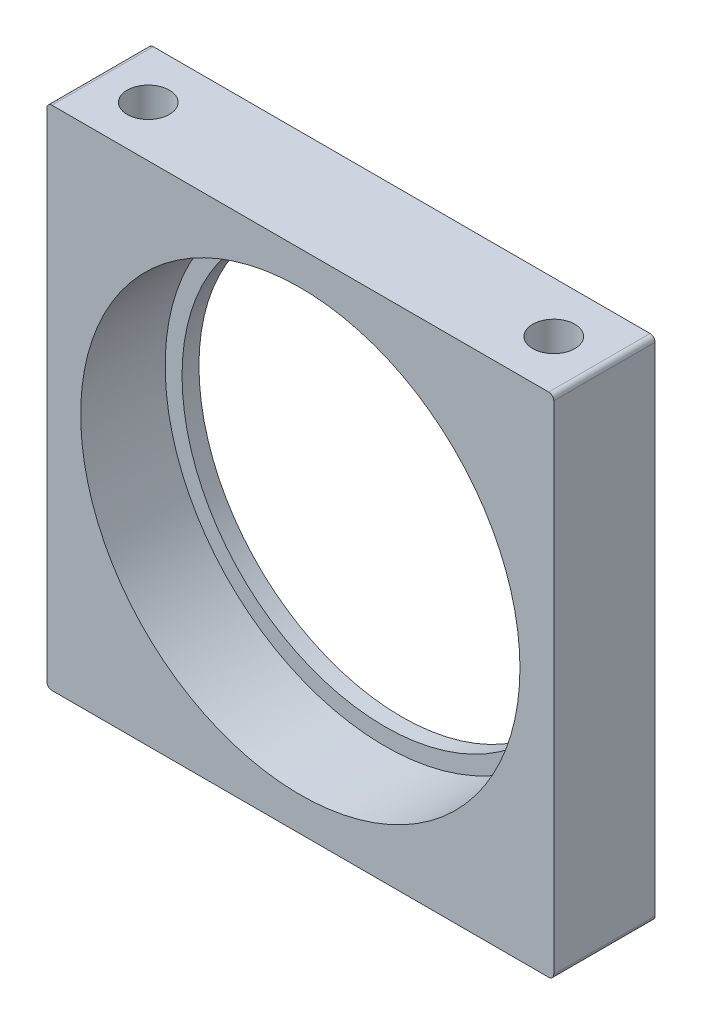
ISO-10303-21;
HEADER;
FILE_DESCRIPTION(('STEP AP214'),'2;1');
FILE_NAME('part.step','',(''),(''),'','','');
FILE_SCHEMA(('AUTOMOTIVE_DESIGN { 1 0 10303 214 1 1 1 1 }'));
ENDSEC;
DATA;
#1=APPLICATION_CONTEXT('core data for automotive mechanical design processes');
#2=APPLICATION_PROTOCOL_DEFINITION('international standard','automotive_design',2000,#1);
#3=PRODUCT_CONTEXT('',#1,'mechanical');
#4=PRODUCT('Part','Part','',(#3));
#5=PRODUCT_RELATED_PRODUCT_CATEGORY('part','',(#4));
#6=PRODUCT_DEFINITION_FORMATION('','',#4);
#7=PRODUCT_DEFINITION_CONTEXT('part definition',#1,'design');
#8=PRODUCT_DEFINITION('design','',#6,#7);
#9=PRODUCT_DEFINITION_SHAPE('','',#8);
#10=(LENGTH_UNIT() NAMED_UNIT(*) SI_UNIT(.MILLI.,.METRE.));
#11=(NAMED_UNIT(*) PLANE_ANGLE_UNIT() SI_UNIT($,.RADIAN.));
#12=(NAMED_UNIT(*) SI_UNIT($,.STERADIAN.) SOLID_ANGLE_UNIT());
#13=UNCERTAINTY_MEASURE_WITH_UNIT(LENGTH_MEASURE(1.E-05),#10,'distance_accuracy_value','');
#14=(GEOMETRIC_REPRESENTATION_CONTEXT(3) GLOBAL_UNCERTAINTY_ASSIGNED_CONTEXT((#13)) GLOBAL_UNIT_ASSIGNED_CONTEXT((#10,
#11,#12)) REPRESENTATION_CONTEXT('',''));
#15=CARTESIAN_POINT('',(0.,0.,0.));
#16=DIRECTION('',(0.,0.,1.));
#17=DIRECTION('',(1.,0.,0.));
#18=AXIS2_PLACEMENT_3D('',#15,#16,#17);
#19=CARTESIAN_POINT('',(15.,15.,6.));
#20=DIRECTION('',(0.,0.,-1.));
#21=DIRECTION('',(-1.,0.,0.));
#22=AXIS2_PLACEMENT_3D('',#19,#20,#21);
#23=CYLINDRICAL_SURFACE('',#22,12.);
#24=CARTESIAN_POINT('',(15.,15.,0.));
#25=DIRECTION('',(0.,0.,1.));
#26=DIRECTION('',(1.,0.,0.));
#27=AXIS2_PLACEMENT_3D('',#24,#25,#26);
#28=CIRCLE('',#27,12.);
#29=CARTESIAN_POINT('',(27.,15.,0.));
#30=VERTEX_POINT('',#29);
#31=EDGE_CURVE('E222',#30,#30,#28,.T.);
#32=ORIENTED_EDGE('',*,*,#31,.F.);
#33=EDGE_LOOP('',(#32));
#34=FACE_BOUND('',#33,.T.);
#35=CARTESIAN_POINT('',(15.,15.,1.));
#36=DIRECTION('',(0.,0.,1.));
#37=DIRECTION('',(1.,0.,0.));
#38=AXIS2_PLACEMENT_3D('',#35,#36,#37);
#39=CIRCLE('',#38,12.);
#40=CARTESIAN_POINT('',(27.,15.,1.));
#41=VERTEX_POINT('',#40);
#42=EDGE_CURVE('E219',#41,#41,#39,.T.);
#43=ORIENTED_EDGE('',*,*,#42,.T.);
#44=EDGE_LOOP('',(#43));
#45=FACE_BOUND('',#44,.T.);
#46=ADVANCED_FACE('F107',(#34,#45),#23,.F.);
#47=CARTESIAN_POINT('',(0.,0.,6.));
#48=DIRECTION('',(0.,0.,-1.));
#49=DIRECTION('',(-1.,0.,0.));
#50=AXIS2_PLACEMENT_3D('',#47,#48,#49);
#51=PLANE('',#50);
#52=CARTESIAN_POINT('',(15.,15.,6.));
#53=DIRECTION('',(0.,0.,1.));
#54=DIRECTION('',(1.,0.,0.));
#55=AXIS2_PLACEMENT_3D('',#52,#53,#54);
#56=CIRCLE('',#55,13.);
#57=CARTESIAN_POINT('',(28.,15.,6.));
#58=VERTEX_POINT('',#57);
#59=EDGE_CURVE('E215',#58,#58,#56,.T.);
#60=ORIENTED_EDGE('',*,*,#59,.F.);
#61=EDGE_LOOP('',(#60));
#62=FACE_BOUND('',#61,.T.);
#63=DIRECTION('',(1.,0.,0.));
#64=VECTOR('',#63,1.);
#65=CARTESIAN_POINT('',(0.,0.,6.));
#66=LINE('',#65,#64);
#67=CARTESIAN_POINT('',(0.3,0.,6.));
#68=VERTEX_POINT('',#67);
#69=CARTESIAN_POINT('',(29.7,0.,6.));
#70=VERTEX_POINT('',#69);
#71=EDGE_CURVE('E229',#68,#70,#66,.T.);
#72=ORIENTED_EDGE('',*,*,#71,.T.);
#73=CARTESIAN_POINT('',(29.7,0.3,6.));
#74=DIRECTION('',(0.,0.,-1.));
#75=DIRECTION('',(-1.,0.,0.));
#76=AXIS2_PLACEMENT_3D('',#73,#74,#75);
#77=CIRCLE('',#76,0.3);
#78=CARTESIAN_POINT('',(30.,0.3,6.));
#79=VERTEX_POINT('',#78);
#80=EDGE_CURVE('E271',#70,#79,#77,.F.);
#81=ORIENTED_EDGE('',*,*,#80,.T.);
#82=DIRECTION('',(0.,1.,0.));
#83=VECTOR('',#82,1.);
#84=CARTESIAN_POINT('',(30.,0.,6.));
#85=LINE('',#84,#83);
#86=CARTESIAN_POINT('',(30.,29.7,6.));
#87=VERTEX_POINT('',#86);
#88=EDGE_CURVE('E233',#79,#87,#85,.T.);
#89=ORIENTED_EDGE('',*,*,#88,.T.);
#90=CARTESIAN_POINT('',(29.7,29.7,6.));
#91=DIRECTION('',(0.,0.,-1.));
#92=DIRECTION('',(-1.,0.,0.));
#93=AXIS2_PLACEMENT_3D('',#90,#91,#92);
#94=CIRCLE('',#93,0.3);
#95=CARTESIAN_POINT('',(29.7,30.,6.));
#96=VERTEX_POINT('',#95);
#97=EDGE_CURVE('E127',#87,#96,#94,.F.);
#98=ORIENTED_EDGE('',*,*,#97,.T.);
#99=DIRECTION('',(-1.,0.,0.));
#100=VECTOR('',#99,1.);
#101=CARTESIAN_POINT('',(0.,30.,6.));
#102=LINE('',#101,#100);
#103=CARTESIAN_POINT('',(0.3,30.,6.));
#104=VERTEX_POINT('',#103);
#105=EDGE_CURVE('E235',#96,#104,#102,.T.);
#106=ORIENTED_EDGE('',*,*,#105,.T.);
#107=CARTESIAN_POINT('',(0.3,29.7,6.));
#108=DIRECTION('',(0.,0.,-1.));
#109=DIRECTION('',(-1.,0.,0.));
#110=AXIS2_PLACEMENT_3D('',#107,#108,#109);
#111=CIRCLE('',#110,0.3);
#112=CARTESIAN_POINT('',(0.,29.7,6.));
#113=VERTEX_POINT('',#112);
#114=EDGE_CURVE('E267',#104,#113,#111,.F.);
#115=ORIENTED_EDGE('',*,*,#114,.T.);
#116=DIRECTION('',(0.,-1.,0.));
#117=VECTOR('',#116,1.);
#118=CARTESIAN_POINT('',(0.,0.,6.));
#119=LINE('',#118,#117);
#120=CARTESIAN_POINT('',(0.,0.3,6.));
#121=VERTEX_POINT('',#120);
#122=EDGE_CURVE('E226',#113,#121,#119,.T.);
#123=ORIENTED_EDGE('',*,*,#122,.T.);
#124=CARTESIAN_POINT('',(0.3,0.3,6.));
#125=DIRECTION('',(0.,0.,-1.));
#126=DIRECTION('',(-1.,0.,0.));
#127=AXIS2_PLACEMENT_3D('',#124,#125,#126);
#128=CIRCLE('',#127,0.3);
#129=EDGE_CURVE('E269',#121,#68,#128,.F.);
#130=ORIENTED_EDGE('',*,*,#129,.T.);
#131=EDGE_LOOP('',(#72,#81,#89,#98,#106,#115,#123,#130));
#132=FACE_BOUND('',#131,.T.);
#133=ADVANCED_FACE('F296',(#62,#132),#51,.F.);
#134=CARTESIAN_POINT('',(0.,0.,0.));
#135=DIRECTION('',(0.,0.,-1.));
#136=DIRECTION('',(-1.,0.,0.));
#137=AXIS2_PLACEMENT_3D('',#134,#135,#136);
#138=PLANE('',#137);
#139=DIRECTION('',(0.,1.,0.));
#140=VECTOR('',#139,1.);
#141=CARTESIAN_POINT('',(30.,0.,0.));
#142=LINE('',#141,#140);
#143=CARTESIAN_POINT('',(30.,0.3,0.));
#144=VERTEX_POINT('',#143);
#145=CARTESIAN_POINT('',(30.,29.7,0.));
#146=VERTEX_POINT('',#145);
#147=EDGE_CURVE('E243',#144,#146,#142,.T.);
#148=ORIENTED_EDGE('',*,*,#147,.F.);
#149=CARTESIAN_POINT('',(29.7,0.3,0.));
#150=DIRECTION('',(0.,0.,-1.));
#151=DIRECTION('',(-1.,0.,0.));
#152=AXIS2_PLACEMENT_3D('',#149,#150,#151);
#153=CIRCLE('',#152,0.3);
#154=CARTESIAN_POINT('',(29.7,0.,0.));
#155=VERTEX_POINT('',#154);
#156=EDGE_CURVE('E259',#144,#155,#153,.T.);
#157=ORIENTED_EDGE('',*,*,#156,.T.);
#158=DIRECTION('',(1.,0.,0.));
#159=VECTOR('',#158,1.);
#160=CARTESIAN_POINT('',(0.,0.,0.));
#161=LINE('',#160,#159);
#162=CARTESIAN_POINT('',(0.3,0.,0.));
#163=VERTEX_POINT('',#162);
#164=EDGE_CURVE('E240',#163,#155,#161,.T.);
#165=ORIENTED_EDGE('',*,*,#164,.F.);
#166=CARTESIAN_POINT('',(0.3,0.3,0.));
#167=DIRECTION('',(0.,0.,-1.));
#168=DIRECTION('',(-1.,0.,0.));
#169=AXIS2_PLACEMENT_3D('',#166,#167,#168);
#170=CIRCLE('',#169,0.3);
#171=CARTESIAN_POINT('',(0.,0.3,0.));
#172=VERTEX_POINT('',#171);
#173=EDGE_CURVE('E257',#163,#172,#170,.T.);
#174=ORIENTED_EDGE('',*,*,#173,.T.);
#175=DIRECTION('',(0.,-1.,0.));
#176=VECTOR('',#175,1.);
#177=CARTESIAN_POINT('',(0.,0.,0.));
#178=LINE('',#177,#176);
#179=CARTESIAN_POINT('',(0.,29.7,0.));
#180=VERTEX_POINT('',#179);
#181=EDGE_CURVE('E225',#180,#172,#178,.T.);
#182=ORIENTED_EDGE('',*,*,#181,.F.);
#183=CARTESIAN_POINT('',(0.3,29.7,0.));
#184=DIRECTION('',(0.,0.,-1.));
#185=DIRECTION('',(-1.,0.,0.));
#186=AXIS2_PLACEMENT_3D('',#183,#184,#185);
#187=CIRCLE('',#186,0.3);
#188=CARTESIAN_POINT('',(0.3,30.,0.));
#189=VERTEX_POINT('',#188);
#190=EDGE_CURVE('E255',#180,#189,#187,.T.);
#191=ORIENTED_EDGE('',*,*,#190,.T.);
#192=DIRECTION('',(-1.,0.,0.));
#193=VECTOR('',#192,1.);
#194=CARTESIAN_POINT('',(0.,30.,0.));
#195=LINE('',#194,#193);
#196=CARTESIAN_POINT('',(29.7,30.,0.));
#197=VERTEX_POINT('',#196);
#198=EDGE_CURVE('E230',#197,#189,#195,.T.);
#199=ORIENTED_EDGE('',*,*,#198,.F.);
#200=CARTESIAN_POINT('',(29.7,29.7,0.));
#201=DIRECTION('',(0.,0.,-1.));
#202=DIRECTION('',(-1.,0.,0.));
#203=AXIS2_PLACEMENT_3D('',#200,#201,#202);
#204=CIRCLE('',#203,0.3);
#205=EDGE_CURVE('E253',#197,#146,#204,.T.);
#206=ORIENTED_EDGE('',*,*,#205,.T.);
#207=EDGE_LOOP('',(#148,#157,#165,#174,#182,#191,#199,#206));
#208=FACE_BOUND('',#207,.T.);
#209=ORIENTED_EDGE('',*,*,#31,.T.);
#210=EDGE_LOOP('',(#209));
#211=FACE_BOUND('',#210,.T.);
#212=ADVANCED_FACE('F284',(#208,#211),#138,.T.);
#213=CARTESIAN_POINT('',(0.,0.,6.));
#214=DIRECTION('',(1.,0.,0.));
#215=DIRECTION('',(0.,0.,-1.));
#216=AXIS2_PLACEMENT_3D('',#213,#214,#215);
#217=PLANE('',#216);
#218=ORIENTED_EDGE('',*,*,#181,.T.);
#219=DIRECTION('',(0.,0.,-1.));
#220=VECTOR('',#219,1.);
#221=CARTESIAN_POINT('',(0.,0.3,6.));
#222=LINE('',#221,#220);
#223=EDGE_CURVE('E276',#172,#121,#222,.F.);
#224=ORIENTED_EDGE('',*,*,#223,.T.);
#225=ORIENTED_EDGE('',*,*,#122,.F.);
#226=DIRECTION('',(0.,0.,-1.));
#227=VECTOR('',#226,1.);
#228=CARTESIAN_POINT('',(0.,29.7,6.));
#229=LINE('',#228,#227);
#230=EDGE_CURVE('E273',#113,#180,#229,.T.);
#231=ORIENTED_EDGE('',*,*,#230,.T.);
#232=EDGE_LOOP('',(#218,#224,#225,#231));
#233=FACE_BOUND('',#232,.T.);
#234=ADVANCED_FACE('F293',(#233),#217,.F.);
#235=CARTESIAN_POINT('',(0.,0.,6.));
#236=DIRECTION('',(0.,1.,0.));
#237=DIRECTION('',(0.,0.,1.));
#238=AXIS2_PLACEMENT_3D('',#235,#236,#237);
#239=PLANE('',#238);
#240=CARTESIAN_POINT('',(3.,0.,3.));
#241=DIRECTION('',(0.,-1.,0.));
#242=DIRECTION('',(0.,0.,-1.));
#243=AXIS2_PLACEMENT_3D('',#240,#241,#242);
#244=CIRCLE('',#243,1.24999999999999);
#245=CARTESIAN_POINT('',(3.,0.,1.75000000000001));
#246=VERTEX_POINT('',#245);
#247=EDGE_CURVE('E193',#246,#246,#244,.T.);
#248=ORIENTED_EDGE('',*,*,#247,.F.);
#249=EDGE_LOOP('',(#248));
#250=FACE_BOUND('',#249,.T.);
#251=CARTESIAN_POINT('',(27.,0.,3.));
#252=DIRECTION('',(0.,-1.,0.));
#253=DIRECTION('',(0.,0.,-1.));
#254=AXIS2_PLACEMENT_3D('',#251,#252,#253);
#255=CIRCLE('',#254,1.24999999999999);
#256=CARTESIAN_POINT('',(27.,0.,1.75000000000001));
#257=VERTEX_POINT('',#256);
#258=EDGE_CURVE('E192',#257,#257,#255,.T.);
#259=ORIENTED_EDGE('',*,*,#258,.F.);
#260=EDGE_LOOP('',(#259));
#261=FACE_BOUND('',#260,.T.);
#262=ORIENTED_EDGE('',*,*,#164,.T.);
#263=DIRECTION('',(0.,0.,-1.));
#264=VECTOR('',#263,1.);
#265=CARTESIAN_POINT('',(29.7,0.,6.));
#266=LINE('',#265,#264);
#267=EDGE_CURVE('E264',#155,#70,#266,.F.);
#268=ORIENTED_EDGE('',*,*,#267,.T.);
#269=ORIENTED_EDGE('',*,*,#71,.F.);
#270=DIRECTION('',(0.,0.,-1.));
#271=VECTOR('',#270,1.);
#272=CARTESIAN_POINT('',(0.3,0.,6.));
#273=LINE('',#272,#271);
#274=EDGE_CURVE('E261',#68,#163,#273,.T.);
#275=ORIENTED_EDGE('',*,*,#274,.T.);
#276=EDGE_LOOP('',(#262,#268,#269,#275));
#277=FACE_BOUND('',#276,.T.);
#278=ADVANCED_FACE('F303',(#250,#261,#277),#239,.F.);
#279=CARTESIAN_POINT('',(30.,0.,6.));
#280=DIRECTION('',(-1.,0.,0.));
#281=DIRECTION('',(0.,0.,1.));
#282=AXIS2_PLACEMENT_3D('',#279,#280,#281);
#283=PLANE('',#282);
#284=ORIENTED_EDGE('',*,*,#88,.F.);
#285=DIRECTION('',(0.,0.,-1.));
#286=VECTOR('',#285,1.);
#287=CARTESIAN_POINT('',(30.,0.3,6.));
#288=LINE('',#287,#286);
#289=EDGE_CURVE('E250',#79,#144,#288,.T.);
#290=ORIENTED_EDGE('',*,*,#289,.T.);
#291=ORIENTED_EDGE('',*,*,#147,.T.);
#292=DIRECTION('',(0.,0.,-1.));
#293=VECTOR('',#292,1.);
#294=CARTESIAN_POINT('',(30.,29.7,6.));
#295=LINE('',#294,#293);
#296=EDGE_CURVE('E237',#146,#87,#295,.F.);
#297=ORIENTED_EDGE('',*,*,#296,.T.);
#298=EDGE_LOOP('',(#284,#290,#291,#297));
#299=FACE_BOUND('',#298,.T.);
#300=ADVANCED_FACE('F311',(#299),#283,.F.);
#301=CARTESIAN_POINT('',(0.,30.,6.));
#302=DIRECTION('',(0.,-1.,0.));
#303=DIRECTION('',(0.,0.,-1.));
#304=AXIS2_PLACEMENT_3D('',#301,#302,#303);
#305=PLANE('',#304);
#306=CARTESIAN_POINT('',(3.,30.,3.));
#307=DIRECTION('',(0.,1.,0.));
#308=DIRECTION('',(0.,0.,1.));
#309=AXIS2_PLACEMENT_3D('',#306,#307,#308);
#310=CIRCLE('',#309,1.24999999999999);
#311=CARTESIAN_POINT('',(3.,30.,4.24999999999999));
#312=VERTEX_POINT('',#311);
#313=EDGE_CURVE('E203',#312,#312,#310,.T.);
#314=ORIENTED_EDGE('',*,*,#313,.F.);
#315=EDGE_LOOP('',(#314));
#316=FACE_BOUND('',#315,.T.);
#317=CARTESIAN_POINT('',(27.,30.,3.));
#318=DIRECTION('',(0.,1.,0.));
#319=DIRECTION('',(0.,0.,1.));
#320=AXIS2_PLACEMENT_3D('',#317,#318,#319);
#321=CIRCLE('',#320,1.24999999999999);
#322=CARTESIAN_POINT('',(27.,30.,4.24999999999999));
#323=VERTEX_POINT('',#322);
#324=EDGE_CURVE('E209',#323,#323,#321,.T.);
#325=ORIENTED_EDGE('',*,*,#324,.F.);
#326=EDGE_LOOP('',(#325));
#327=FACE_BOUND('',#326,.T.);
#328=ORIENTED_EDGE('',*,*,#198,.T.);
#329=DIRECTION('',(0.,0.,-1.));
#330=VECTOR('',#329,1.);
#331=CARTESIAN_POINT('',(0.3,30.,6.));
#332=LINE('',#331,#330);
#333=EDGE_CURVE('E14',#189,#104,#332,.F.);
#334=ORIENTED_EDGE('',*,*,#333,.T.);
#335=ORIENTED_EDGE('',*,*,#105,.F.);
#336=DIRECTION('',(0.,0.,-1.));
#337=VECTOR('',#336,1.);
#338=CARTESIAN_POINT('',(29.7,30.,6.));
#339=LINE('',#338,#337);
#340=EDGE_CURVE('E115',#96,#197,#339,.T.);
#341=ORIENTED_EDGE('',*,*,#340,.T.);
#342=EDGE_LOOP('',(#328,#334,#335,#341));
#343=FACE_BOUND('',#342,.T.);
#344=ADVANCED_FACE('F280',(#316,#327,#343),#305,.F.);
#345=CARTESIAN_POINT('',(15.,15.,1.));
#346=DIRECTION('',(0.,0.,1.));
#347=DIRECTION('',(1.,0.,0.));
#348=AXIS2_PLACEMENT_3D('',#345,#346,#347);
#349=CYLINDRICAL_SURFACE('',#348,13.);
#350=CARTESIAN_POINT('',(15.,15.,1.));
#351=DIRECTION('',(0.,0.,1.));
#352=DIRECTION('',(1.,0.,0.));
#353=AXIS2_PLACEMENT_3D('',#350,#351,#352);
#354=CIRCLE('',#353,13.);
#355=CARTESIAN_POINT('',(28.,15.,1.));
#356=VERTEX_POINT('',#355);
#357=EDGE_CURVE('E216',#356,#356,#354,.T.);
#358=ORIENTED_EDGE('',*,*,#357,.F.);
#359=EDGE_LOOP('',(#358));
#360=FACE_BOUND('',#359,.T.);
#361=ORIENTED_EDGE('',*,*,#59,.T.);
#362=EDGE_LOOP('',(#361));
#363=FACE_BOUND('',#362,.T.);
#364=ADVANCED_FACE('F328',(#360,#363),#349,.F.);
#365=CARTESIAN_POINT('',(15.,15.,1.));
#366=DIRECTION('',(0.,0.,1.));
#367=DIRECTION('',(1.,0.,0.));
#368=AXIS2_PLACEMENT_3D('',#365,#366,#367);
#369=PLANE('',#368);
#370=ORIENTED_EDGE('',*,*,#42,.F.);
#371=EDGE_LOOP('',(#370));
#372=FACE_BOUND('',#371,.T.);
#373=ORIENTED_EDGE('',*,*,#357,.T.);
#374=EDGE_LOOP('',(#373));
#375=FACE_BOUND('',#374,.T.);
#376=ADVANCED_FACE('F433',(#372,#375),#369,.T.);
#377=CARTESIAN_POINT('',(27.,24.,3.));
#378=DIRECTION('',(0.,1.,0.));
#379=DIRECTION('',(0.,0.,1.));
#380=AXIS2_PLACEMENT_3D('',#377,#378,#379);
#381=CONICAL_SURFACE('',#380,1.25,1.02974425867665);
#382=CARTESIAN_POINT('',(27.,23.2489242262155,3.));
#383=VERTEX_POINT('',#382);
#384=VERTEX_LOOP('',#383);
#385=FACE_BOUND('',#384,.T.);
#386=CARTESIAN_POINT('',(27.,24.,3.));
#387=DIRECTION('',(0.,1.,0.));
#388=DIRECTION('',(0.,0.,1.));
#389=AXIS2_PLACEMENT_3D('',#386,#387,#388);
#390=CIRCLE('',#389,1.25);
#391=CARTESIAN_POINT('',(27.,24.,4.25));
#392=VERTEX_POINT('',#391);
#393=EDGE_CURVE('E212',#392,#392,#390,.T.);
#394=ORIENTED_EDGE('',*,*,#393,.T.);
#395=EDGE_LOOP('',(#394));
#396=FACE_BOUND('',#395,.T.);
#397=ADVANCED_FACE('F424',(#385,#396),#381,.F.);
#398=CARTESIAN_POINT('',(27.,30.,3.));
#399=DIRECTION('',(0.,1.,0.));
#400=DIRECTION('',(0.,0.,1.));
#401=AXIS2_PLACEMENT_3D('',#398,#399,#400);
#402=CYLINDRICAL_SURFACE('',#401,1.24999999999999);
#403=ORIENTED_EDGE('',*,*,#393,.F.);
#404=EDGE_LOOP('',(#403));
#405=FACE_BOUND('',#404,.T.);
#406=ORIENTED_EDGE('',*,*,#324,.T.);
#407=EDGE_LOOP('',(#406));
#408=FACE_BOUND('',#407,.T.);
#409=ADVANCED_FACE('F415',(#405,#408),#402,.F.);
#410=CARTESIAN_POINT('',(3.,24.,3.));
#411=DIRECTION('',(0.,1.,0.));
#412=DIRECTION('',(0.,0.,1.));
#413=AXIS2_PLACEMENT_3D('',#410,#411,#412);
#414=CONICAL_SURFACE('',#413,1.25,1.02974425867665);
#415=CARTESIAN_POINT('',(3.,23.2489242262155,3.));
#416=VERTEX_POINT('',#415);
#417=VERTEX_LOOP('',#416);
#418=FACE_BOUND('',#417,.T.);
#419=CARTESIAN_POINT('',(3.,24.,3.));
#420=DIRECTION('',(0.,1.,0.));
#421=DIRECTION('',(0.,0.,1.));
#422=AXIS2_PLACEMENT_3D('',#419,#420,#421);
#423=CIRCLE('',#422,1.25);
#424=CARTESIAN_POINT('',(3.,24.,4.25));
#425=VERTEX_POINT('',#424);
#426=EDGE_CURVE('E206',#425,#425,#423,.T.);
#427=ORIENTED_EDGE('',*,*,#426,.T.);
#428=EDGE_LOOP('',(#427));
#429=FACE_BOUND('',#428,.T.);
#430=ADVANCED_FACE('F406',(#418,#429),#414,.F.);
#431=CARTESIAN_POINT('',(3.,30.,3.));
#432=DIRECTION('',(0.,1.,0.));
#433=DIRECTION('',(0.,0.,1.));
#434=AXIS2_PLACEMENT_3D('',#431,#432,#433);
#435=CYLINDRICAL_SURFACE('',#434,1.24999999999999);
#436=ORIENTED_EDGE('',*,*,#426,.F.);
#437=EDGE_LOOP('',(#436));
#438=FACE_BOUND('',#437,.T.);
#439=ORIENTED_EDGE('',*,*,#313,.T.);
#440=EDGE_LOOP('',(#439));
#441=FACE_BOUND('',#440,.T.);
#442=ADVANCED_FACE('F397',(#438,#441),#435,.F.);
#443=CARTESIAN_POINT('',(27.,6.,3.));
#444=DIRECTION('',(0.,-1.,0.));
#445=DIRECTION('',(0.,0.,-1.));
#446=AXIS2_PLACEMENT_3D('',#443,#444,#445);
#447=CONICAL_SURFACE('',#446,1.25,1.02974425867665);
#448=CARTESIAN_POINT('',(27.,6.75107577378445,3.));
#449=VERTEX_POINT('',#448);
#450=VERTEX_LOOP('',#449);
#451=FACE_BOUND('',#450,.T.);
#452=CARTESIAN_POINT('',(27.,6.,3.));
#453=DIRECTION('',(0.,-1.,0.));
#454=DIRECTION('',(0.,0.,-1.));
#455=AXIS2_PLACEMENT_3D('',#452,#453,#454);
#456=CIRCLE('',#455,1.25);
#457=CARTESIAN_POINT('',(27.,6.,1.75));
#458=VERTEX_POINT('',#457);
#459=EDGE_CURVE('E196',#458,#458,#456,.T.);
#460=ORIENTED_EDGE('',*,*,#459,.T.);
#461=EDGE_LOOP('',(#460));
#462=FACE_BOUND('',#461,.T.);
#463=ADVANCED_FACE('F388',(#451,#462),#447,.F.);
#464=CARTESIAN_POINT('',(27.,0.,3.));
#465=DIRECTION('',(0.,-1.,0.));
#466=DIRECTION('',(0.,0.,-1.));
#467=AXIS2_PLACEMENT_3D('',#464,#465,#466);
#468=CYLINDRICAL_SURFACE('',#467,1.24999999999999);
#469=ORIENTED_EDGE('',*,*,#459,.F.);
#470=EDGE_LOOP('',(#469));
#471=FACE_BOUND('',#470,.T.);
#472=ORIENTED_EDGE('',*,*,#258,.T.);
#473=EDGE_LOOP('',(#472));
#474=FACE_BOUND('',#473,.T.);
#475=ADVANCED_FACE('F186',(#471,#474),#468,.F.);
#476=CARTESIAN_POINT('',(3.,6.,3.));
#477=DIRECTION('',(0.,-1.,0.));
#478=DIRECTION('',(0.,0.,-1.));
#479=AXIS2_PLACEMENT_3D('',#476,#477,#478);
#480=CONICAL_SURFACE('',#479,1.25,1.02974425867665);
#481=CARTESIAN_POINT('',(3.,6.75107577378445,3.));
#482=VERTEX_POINT('',#481);
#483=VERTEX_LOOP('',#482);
#484=FACE_BOUND('',#483,.T.);
#485=CARTESIAN_POINT('',(3.,6.,3.));
#486=DIRECTION('',(0.,-1.,0.));
#487=DIRECTION('',(0.,0.,-1.));
#488=AXIS2_PLACEMENT_3D('',#485,#486,#487);
#489=CIRCLE('',#488,1.25);
#490=CARTESIAN_POINT('',(3.,6.,1.75));
#491=VERTEX_POINT('',#490);
#492=EDGE_CURVE('E190',#491,#491,#489,.T.);
#493=ORIENTED_EDGE('',*,*,#492,.T.);
#494=EDGE_LOOP('',(#493));
#495=FACE_BOUND('',#494,.T.);
#496=ADVANCED_FACE('F182',(#484,#495),#480,.F.);
#497=CARTESIAN_POINT('',(3.,0.,3.));
#498=DIRECTION('',(0.,-1.,0.));
#499=DIRECTION('',(0.,0.,-1.));
#500=AXIS2_PLACEMENT_3D('',#497,#498,#499);
#501=CYLINDRICAL_SURFACE('',#500,1.24999999999999);
#502=ORIENTED_EDGE('',*,*,#492,.F.);
#503=EDGE_LOOP('',(#502));
#504=FACE_BOUND('',#503,.T.);
#505=ORIENTED_EDGE('',*,*,#247,.T.);
#506=EDGE_LOOP('',(#505));
#507=FACE_BOUND('',#506,.T.);
#508=ADVANCED_FACE('F185',(#504,#507),#501,.F.);
#509=CARTESIAN_POINT('',(29.7,0.3,6.));
#510=DIRECTION('',(0.,0.,-1.));
#511=DIRECTION('',(-1.,0.,0.));
#512=AXIS2_PLACEMENT_3D('',#509,#510,#511);
#513=CYLINDRICAL_SURFACE('',#512,0.3);
#514=ORIENTED_EDGE('',*,*,#80,.F.);
#515=ORIENTED_EDGE('',*,*,#267,.F.);
#516=ORIENTED_EDGE('',*,*,#156,.F.);
#517=ORIENTED_EDGE('',*,*,#289,.F.);
#518=EDGE_LOOP('',(#514,#515,#516,#517));
#519=FACE_BOUND('',#518,.T.);
#520=ADVANCED_FACE('F308',(#519),#513,.T.);
#521=CARTESIAN_POINT('',(0.3,0.3,6.));
#522=DIRECTION('',(0.,0.,-1.));
#523=DIRECTION('',(-1.,0.,0.));
#524=AXIS2_PLACEMENT_3D('',#521,#522,#523);
#525=CYLINDRICAL_SURFACE('',#524,0.3);
#526=ORIENTED_EDGE('',*,*,#129,.F.);
#527=ORIENTED_EDGE('',*,*,#223,.F.);
#528=ORIENTED_EDGE('',*,*,#173,.F.);
#529=ORIENTED_EDGE('',*,*,#274,.F.);
#530=EDGE_LOOP('',(#526,#527,#528,#529));
#531=FACE_BOUND('',#530,.T.);
#532=ADVANCED_FACE('F300',(#531),#525,.T.);
#533=CARTESIAN_POINT('',(0.3,29.7,6.));
#534=DIRECTION('',(0.,0.,-1.));
#535=DIRECTION('',(-1.,0.,0.));
#536=AXIS2_PLACEMENT_3D('',#533,#534,#535);
#537=CYLINDRICAL_SURFACE('',#536,0.3);
#538=ORIENTED_EDGE('',*,*,#114,.F.);
#539=ORIENTED_EDGE('',*,*,#333,.F.);
#540=ORIENTED_EDGE('',*,*,#190,.F.);
#541=ORIENTED_EDGE('',*,*,#230,.F.);
#542=EDGE_LOOP('',(#538,#539,#540,#541));
#543=FACE_BOUND('',#542,.T.);
#544=ADVANCED_FACE('F290',(#543),#537,.T.);
#545=CARTESIAN_POINT('',(29.7,29.7,6.));
#546=DIRECTION('',(0.,0.,-1.));
#547=DIRECTION('',(-1.,0.,0.));
#548=AXIS2_PLACEMENT_3D('',#545,#546,#547);
#549=CYLINDRICAL_SURFACE('',#548,0.3);
#550=ORIENTED_EDGE('',*,*,#97,.F.);
#551=ORIENTED_EDGE('',*,*,#296,.F.);
#552=ORIENTED_EDGE('',*,*,#205,.F.);
#553=ORIENTED_EDGE('',*,*,#340,.F.);
#554=EDGE_LOOP('',(#550,#551,#552,#553));
#555=FACE_BOUND('',#554,.T.);
#556=ADVANCED_FACE('F109',(#555),#549,.T.);
#557=CLOSED_SHELL('',(#46,#133,#212,#234,#278,#300,#344,#364,#376,#397,#409,#430,#442,#463,#475,
#496,#508,#520,#532,#544,#556));
#558=MANIFOLD_SOLID_BREP('B2',#557);
#559=ADVANCED_BREP_SHAPE_REPRESENTATION('',(#18,#558),#14);
#560=SHAPE_DEFINITION_REPRESENTATION(#9,#559);
ENDSEC;
END-ISO-10303-21;
